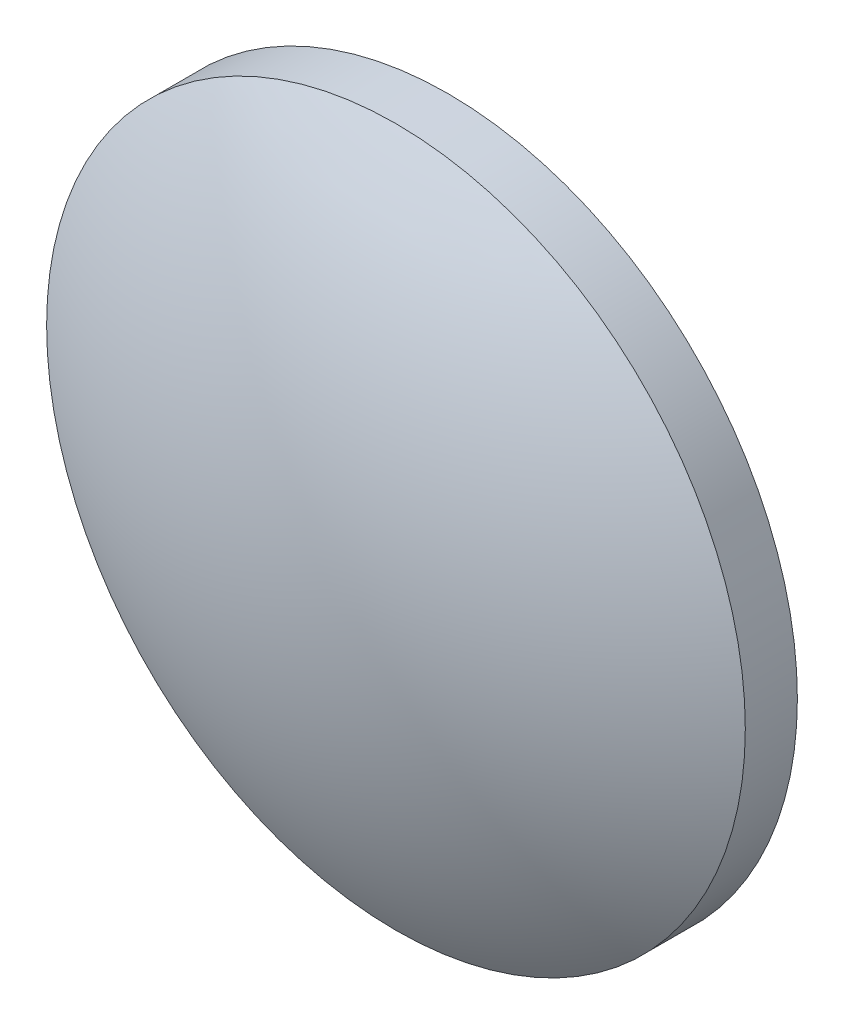
ISO-10303-21;
HEADER;
FILE_DESCRIPTION(('STEP AP214'),'2;1');
FILE_NAME('part.step','',(''),(''),'','','');
FILE_SCHEMA(('AUTOMOTIVE_DESIGN { 1 0 10303 214 1 1 1 1 }'));
ENDSEC;
DATA;
#1=APPLICATION_CONTEXT('core data for automotive mechanical design processes');
#2=APPLICATION_PROTOCOL_DEFINITION('international standard','automotive_design',2000,#1);
#3=PRODUCT_CONTEXT('',#1,'mechanical');
#4=PRODUCT('Part','Part','',(#3));
#5=PRODUCT_RELATED_PRODUCT_CATEGORY('part','',(#4));
#6=PRODUCT_DEFINITION_FORMATION('','',#4);
#7=PRODUCT_DEFINITION_CONTEXT('part definition',#1,'design');
#8=PRODUCT_DEFINITION('design','',#6,#7);
#9=PRODUCT_DEFINITION_SHAPE('','',#8);
#10=(LENGTH_UNIT() NAMED_UNIT(*) SI_UNIT(.MILLI.,.METRE.));
#11=(NAMED_UNIT(*) PLANE_ANGLE_UNIT() SI_UNIT($,.RADIAN.));
#12=(NAMED_UNIT(*) SI_UNIT($,.STERADIAN.) SOLID_ANGLE_UNIT());
#13=UNCERTAINTY_MEASURE_WITH_UNIT(LENGTH_MEASURE(1.E-05),#10,'distance_accuracy_value','');
#14=(GEOMETRIC_REPRESENTATION_CONTEXT(3) GLOBAL_UNCERTAINTY_ASSIGNED_CONTEXT((#13)) GLOBAL_UNIT_ASSIGNED_CONTEXT((#10,
#11,#12)) REPRESENTATION_CONTEXT('',''));
#15=CARTESIAN_POINT('',(0.,0.,0.));
#16=DIRECTION('',(0.,0.,1.));
#17=DIRECTION('',(1.,0.,0.));
#18=AXIS2_PLACEMENT_3D('',#15,#16,#17);
#19=CARTESIAN_POINT('',(0.,0.,20.04));
#20=DIRECTION('',(0.,0.,1.));
#21=DIRECTION('',(0.,1.,0.));
#22=AXIS2_PLACEMENT_3D('',#19,#20,#21);
#23=SPHERICAL_SURFACE('',#22,24.53);
#24=CARTESIAN_POINT('',(0.,0.,-0.946445625688977));
#25=DIRECTION('',(0.,0.,1.));
#26=DIRECTION('',(1.,0.,0.));
#27=AXIS2_PLACEMENT_3D('',#24,#25,#26);
#28=CIRCLE('',#27,12.7);
#29=CARTESIAN_POINT('',(12.7,0.,-0.946445625688977));
#30=VERTEX_POINT('',#29);
#31=EDGE_CURVE('E8',#30,#30,#28,.T.);
#32=ORIENTED_EDGE('',*,*,#31,.F.);
#33=EDGE_LOOP('',(#32));
#34=FACE_BOUND('',#33,.T.);
#35=ADVANCED_FACE('F12',(#34),#23,.T.);
#36=CARTESIAN_POINT('',(0.,0.,6.49100038893206));
#37=DIRECTION('',(0.,0.,1.));
#38=DIRECTION('',(1.,0.,0.));
#39=AXIS2_PLACEMENT_3D('',#36,#37,#38);
#40=CYLINDRICAL_SURFACE('',#39,12.7);
#41=CARTESIAN_POINT('',(0.,0.,0.94644562568898));
#42=DIRECTION('',(0.,0.,1.));
#43=DIRECTION('',(1.,0.,0.));
#44=AXIS2_PLACEMENT_3D('',#41,#42,#43);
#45=CIRCLE('',#44,12.7);
#46=CARTESIAN_POINT('',(12.7,0.,0.94644562568898));
#47=VERTEX_POINT('',#46);
#48=EDGE_CURVE('E18',#47,#47,#45,.T.);
#49=ORIENTED_EDGE('',*,*,#48,.F.);
#50=EDGE_LOOP('',(#49));
#51=FACE_BOUND('',#50,.T.);
#52=ORIENTED_EDGE('',*,*,#31,.T.);
#53=EDGE_LOOP('',(#52));
#54=FACE_BOUND('',#53,.T.);
#55=ADVANCED_FACE('F26',(#51,#54),#40,.T.);
#56=CARTESIAN_POINT('',(0.,0.,-20.04));
#57=DIRECTION('',(0.,0.,1.));
#58=DIRECTION('',(0.,1.,0.));
#59=AXIS2_PLACEMENT_3D('',#56,#57,#58);
#60=SPHERICAL_SURFACE('',#59,24.53);
#61=ORIENTED_EDGE('',*,*,#48,.T.);
#62=EDGE_LOOP('',(#61));
#63=FACE_BOUND('',#62,.T.);
#64=ADVANCED_FACE('F24',(#63),#60,.T.);
#65=CLOSED_SHELL('',(#35,#55,#64));
#66=MANIFOLD_SOLID_BREP('B1',#65);
#67=ADVANCED_BREP_SHAPE_REPRESENTATION('',(#18,#66),#14);
#68=SHAPE_DEFINITION_REPRESENTATION(#9,#67);
ENDSEC;
END-ISO-10303-21;
